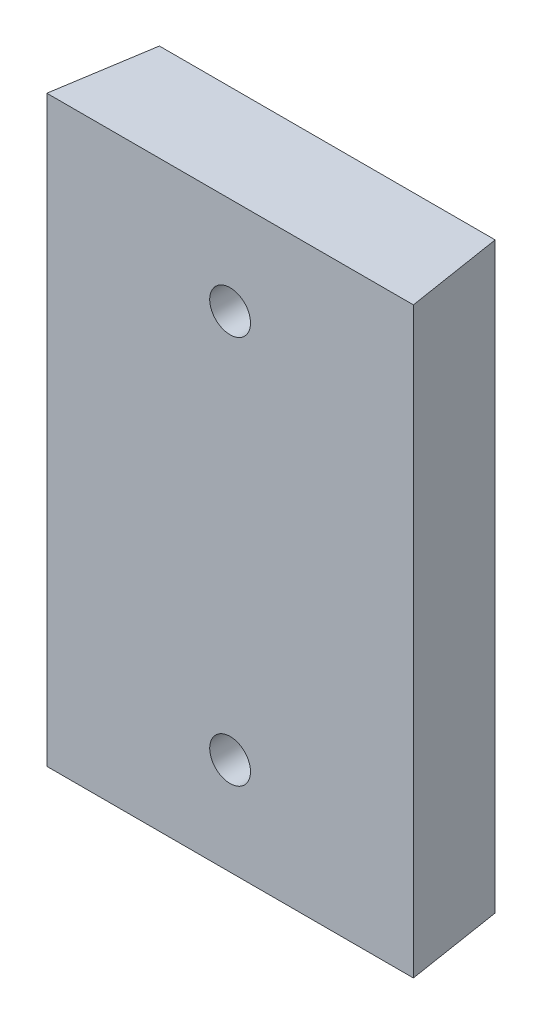
ISO-10303-21;
HEADER;
FILE_DESCRIPTION(('STEP AP214'),'2;1');
FILE_NAME('part.step','',(''),(''),'','','');
FILE_SCHEMA(('AUTOMOTIVE_DESIGN { 1 0 10303 214 1 1 1 1 }'));
ENDSEC;
DATA;
#1=APPLICATION_CONTEXT('core data for automotive mechanical design processes');
#2=APPLICATION_PROTOCOL_DEFINITION('international standard','automotive_design',2000,#1);
#3=PRODUCT_CONTEXT('',#1,'mechanical');
#4=PRODUCT('Part','Part','',(#3));
#5=PRODUCT_RELATED_PRODUCT_CATEGORY('part','',(#4));
#6=PRODUCT_DEFINITION_FORMATION('','',#4);
#7=PRODUCT_DEFINITION_CONTEXT('part definition',#1,'design');
#8=PRODUCT_DEFINITION('design','',#6,#7);
#9=PRODUCT_DEFINITION_SHAPE('','',#8);
#10=(LENGTH_UNIT() NAMED_UNIT(*) SI_UNIT(.MILLI.,.METRE.));
#11=(NAMED_UNIT(*) PLANE_ANGLE_UNIT() SI_UNIT($,.RADIAN.));
#12=(NAMED_UNIT(*) SI_UNIT($,.STERADIAN.) SOLID_ANGLE_UNIT());
#13=UNCERTAINTY_MEASURE_WITH_UNIT(LENGTH_MEASURE(1.E-05),#10,'distance_accuracy_value','');
#14=(GEOMETRIC_REPRESENTATION_CONTEXT(3) GLOBAL_UNCERTAINTY_ASSIGNED_CONTEXT((#13)) GLOBAL_UNIT_ASSIGNED_CONTEXT((#10,
#11,#12)) REPRESENTATION_CONTEXT('',''));
#15=CARTESIAN_POINT('',(0.,0.,0.));
#16=DIRECTION('',(0.,0.,1.));
#17=DIRECTION('',(1.,0.,0.));
#18=AXIS2_PLACEMENT_3D('',#15,#16,#17);
#19=CARTESIAN_POINT('',(0.,0.,10.));
#20=DIRECTION('',(0.,0.,-1.));
#21=DIRECTION('',(-1.,0.,0.));
#22=AXIS2_PLACEMENT_3D('',#19,#20,#21);
#23=PLANE('',#22);
#24=DIRECTION('',(1.,0.,0.));
#25=VECTOR('',#24,1.);
#26=CARTESIAN_POINT('',(-21.9008251056324,-30.,10.));
#27=LINE('',#26,#25);
#28=CARTESIAN_POINT('',(-18.8634297282684,-30.,10.));
#29=VERTEX_POINT('',#28);
#30=CARTESIAN_POINT('',(18.8634297282684,-30.,10.));
#31=VERTEX_POINT('',#30);
#32=EDGE_CURVE('E80',#29,#31,#27,.T.);
#33=ORIENTED_EDGE('',*,*,#32,.T.);
#34=DIRECTION('',(0.,1.,0.));
#35=VECTOR('',#34,1.);
#36=CARTESIAN_POINT('',(18.8634297282684,0.,10.));
#37=LINE('',#36,#35);
#38=CARTESIAN_POINT('',(18.8634297282684,30.,10.));
#39=VERTEX_POINT('',#38);
#40=EDGE_CURVE('E73',#31,#39,#37,.T.);
#41=ORIENTED_EDGE('',*,*,#40,.T.);
#42=DIRECTION('',(-1.,0.,0.));
#43=VECTOR('',#42,1.);
#44=CARTESIAN_POINT('',(-21.9008251056324,30.,10.));
#45=LINE('',#44,#43);
#46=CARTESIAN_POINT('',(-18.8634297282684,30.,10.));
#47=VERTEX_POINT('',#46);
#48=EDGE_CURVE('E55',#39,#47,#45,.T.);
#49=ORIENTED_EDGE('',*,*,#48,.T.);
#50=DIRECTION('',(0.,-1.,0.));
#51=VECTOR('',#50,1.);
#52=CARTESIAN_POINT('',(-18.8634297282684,0.,10.));
#53=LINE('',#52,#51);
#54=EDGE_CURVE('E101',#47,#29,#53,.T.);
#55=ORIENTED_EDGE('',*,*,#54,.T.);
#56=EDGE_LOOP('',(#33,#41,#49,#55));
#57=FACE_BOUND('',#56,.T.);
#58=CARTESIAN_POINT('',(0.,-20.,10.));
#59=DIRECTION('',(0.,0.,1.));
#60=DIRECTION('',(1.,0.,0.));
#61=AXIS2_PLACEMENT_3D('',#58,#59,#60);
#62=CIRCLE('',#61,2.10000000000001);
#63=CARTESIAN_POINT('',(2.09999999999993,-20.,10.));
#64=VERTEX_POINT('',#63);
#65=EDGE_CURVE('E94',#64,#64,#62,.T.);
#66=ORIENTED_EDGE('',*,*,#65,.F.);
#67=EDGE_LOOP('',(#66));
#68=FACE_BOUND('',#67,.T.);
#69=CARTESIAN_POINT('',(0.,20.,10.));
#70=DIRECTION('',(0.,0.,1.));
#71=DIRECTION('',(1.,0.,0.));
#72=AXIS2_PLACEMENT_3D('',#69,#70,#71);
#73=CIRCLE('',#72,2.10000000000001);
#74=CARTESIAN_POINT('',(2.09999999999993,20.,10.));
#75=VERTEX_POINT('',#74);
#76=EDGE_CURVE('E110',#75,#75,#73,.T.);
#77=ORIENTED_EDGE('',*,*,#76,.F.);
#78=EDGE_LOOP('',(#77));
#79=FACE_BOUND('',#78,.T.);
#80=ADVANCED_FACE('F33',(#57,#68,#79),#23,.F.);
#81=CARTESIAN_POINT('',(0.,0.,0.));
#82=DIRECTION('',(0.,0.,-1.));
#83=DIRECTION('',(-1.,0.,0.));
#84=AXIS2_PLACEMENT_3D('',#81,#82,#83);
#85=PLANE('',#84);
#86=DIRECTION('',(0.,1.,0.));
#87=VECTOR('',#86,1.);
#88=CARTESIAN_POINT('',(17.2795853250231,0.,0.));
#89=LINE('',#88,#87);
#90=CARTESIAN_POINT('',(17.2795853250231,-30.,0.));
#91=VERTEX_POINT('',#90);
#92=CARTESIAN_POINT('',(17.2795853250231,30.,0.));
#93=VERTEX_POINT('',#92);
#94=EDGE_CURVE('E48',#91,#93,#89,.T.);
#95=ORIENTED_EDGE('',*,*,#94,.F.);
#96=DIRECTION('',(1.,0.,0.));
#97=VECTOR('',#96,1.);
#98=CARTESIAN_POINT('',(-21.9008251056324,-30.,0.));
#99=LINE('',#98,#97);
#100=CARTESIAN_POINT('',(-17.2795853250231,-30.,0.));
#101=VERTEX_POINT('',#100);
#102=EDGE_CURVE('E91',#101,#91,#99,.T.);
#103=ORIENTED_EDGE('',*,*,#102,.F.);
#104=DIRECTION('',(0.,-1.,0.));
#105=VECTOR('',#104,1.);
#106=CARTESIAN_POINT('',(-17.2795853250231,0.,0.));
#107=LINE('',#106,#105);
#108=CARTESIAN_POINT('',(-17.2795853250231,30.,0.));
#109=VERTEX_POINT('',#108);
#110=EDGE_CURVE('E99',#109,#101,#107,.T.);
#111=ORIENTED_EDGE('',*,*,#110,.F.);
#112=DIRECTION('',(-1.,0.,0.));
#113=VECTOR('',#112,1.);
#114=CARTESIAN_POINT('',(-21.9008251056324,30.,0.));
#115=LINE('',#114,#113);
#116=EDGE_CURVE('E87',#93,#109,#115,.T.);
#117=ORIENTED_EDGE('',*,*,#116,.F.);
#118=EDGE_LOOP('',(#95,#103,#111,#117));
#119=FACE_BOUND('',#118,.T.);
#120=CARTESIAN_POINT('',(0.,-20.,0.));
#121=DIRECTION('',(0.,0.,1.));
#122=DIRECTION('',(1.,0.,0.));
#123=AXIS2_PLACEMENT_3D('',#120,#121,#122);
#124=CIRCLE('',#123,2.10000000000001);
#125=CARTESIAN_POINT('',(2.09999999999993,-20.,0.));
#126=VERTEX_POINT('',#125);
#127=EDGE_CURVE('E113',#126,#126,#124,.T.);
#128=ORIENTED_EDGE('',*,*,#127,.T.);
#129=EDGE_LOOP('',(#128));
#130=FACE_BOUND('',#129,.T.);
#131=CARTESIAN_POINT('',(0.,20.,0.));
#132=DIRECTION('',(0.,0.,1.));
#133=DIRECTION('',(1.,0.,0.));
#134=AXIS2_PLACEMENT_3D('',#131,#132,#133);
#135=CIRCLE('',#134,2.10000000000001);
#136=CARTESIAN_POINT('',(2.09999999999993,20.,0.));
#137=VERTEX_POINT('',#136);
#138=EDGE_CURVE('E106',#137,#137,#135,.T.);
#139=ORIENTED_EDGE('',*,*,#138,.T.);
#140=EDGE_LOOP('',(#139));
#141=FACE_BOUND('',#140,.T.);
#142=ADVANCED_FACE('F103',(#119,#130,#141),#85,.T.);
#143=CARTESIAN_POINT('',(-21.9008251056324,-30.,10.));
#144=DIRECTION('',(0.,1.,0.));
#145=DIRECTION('',(0.,0.,1.));
#146=AXIS2_PLACEMENT_3D('',#143,#144,#145);
#147=PLANE('',#146);
#148=ORIENTED_EDGE('',*,*,#102,.T.);
#149=DIRECTION('',(0.156434465040228,0.,0.987688340595138));
#150=VECTOR('',#149,1.);
#151=CARTESIAN_POINT('',(17.8658574071668,-30.,3.70157624664689));
#152=LINE('',#151,#150);
#153=EDGE_CURVE('E144',#91,#31,#152,.T.);
#154=ORIENTED_EDGE('',*,*,#153,.T.);
#155=ORIENTED_EDGE('',*,*,#32,.F.);
#156=DIRECTION('',(0.156434465040228,0.,-0.987688340595138));
#157=VECTOR('',#156,1.);
#158=CARTESIAN_POINT('',(-18.937760083847,-30.,10.4693033951207));
#159=LINE('',#158,#157);
#160=EDGE_CURVE('E81',#29,#101,#159,.T.);
#161=ORIENTED_EDGE('',*,*,#160,.T.);
#162=EDGE_LOOP('',(#148,#154,#155,#161));
#163=FACE_BOUND('',#162,.T.);
#164=ADVANCED_FACE('F35',(#163),#147,.F.);
#165=CARTESIAN_POINT('',(-21.9008251056324,30.,10.));
#166=DIRECTION('',(0.,-1.,0.));
#167=DIRECTION('',(0.,0.,-1.));
#168=AXIS2_PLACEMENT_3D('',#165,#166,#167);
#169=PLANE('',#168);
#170=ORIENTED_EDGE('',*,*,#48,.F.);
#171=DIRECTION('',(-0.156434465040228,0.,-0.987688340595138));
#172=VECTOR('',#171,1.);
#173=CARTESIAN_POINT('',(17.8658574071668,30.,3.70157624664689));
#174=LINE('',#173,#172);
#175=EDGE_CURVE('E11',#39,#93,#174,.T.);
#176=ORIENTED_EDGE('',*,*,#175,.T.);
#177=ORIENTED_EDGE('',*,*,#116,.T.);
#178=DIRECTION('',(-0.156434465040228,0.,0.987688340595138));
#179=VECTOR('',#178,1.);
#180=CARTESIAN_POINT('',(-18.937760083847,30.,10.4693033951207));
#181=LINE('',#180,#179);
#182=EDGE_CURVE('E41',#109,#47,#181,.T.);
#183=ORIENTED_EDGE('',*,*,#182,.T.);
#184=EDGE_LOOP('',(#170,#176,#177,#183));
#185=FACE_BOUND('',#184,.T.);
#186=ADVANCED_FACE('F84',(#185),#169,.F.);
#187=CARTESIAN_POINT('',(0.,-20.,10.));
#188=DIRECTION('',(0.,0.,-1.));
#189=DIRECTION('',(-1.,0.,0.));
#190=AXIS2_PLACEMENT_3D('',#187,#188,#189);
#191=CYLINDRICAL_SURFACE('',#190,2.10000000000001);
#192=ORIENTED_EDGE('',*,*,#65,.T.);
#193=EDGE_LOOP('',(#192));
#194=FACE_BOUND('',#193,.T.);
#195=ORIENTED_EDGE('',*,*,#127,.F.);
#196=EDGE_LOOP('',(#195));
#197=FACE_BOUND('',#196,.T.);
#198=ADVANCED_FACE('F121',(#194,#197),#191,.F.);
#199=CARTESIAN_POINT('',(0.,20.,10.));
#200=DIRECTION('',(0.,0.,-1.));
#201=DIRECTION('',(-1.,0.,0.));
#202=AXIS2_PLACEMENT_3D('',#199,#200,#201);
#203=CYLINDRICAL_SURFACE('',#202,2.10000000000001);
#204=ORIENTED_EDGE('',*,*,#76,.T.);
#205=EDGE_LOOP('',(#204));
#206=FACE_BOUND('',#205,.T.);
#207=ORIENTED_EDGE('',*,*,#138,.F.);
#208=EDGE_LOOP('',(#207));
#209=FACE_BOUND('',#208,.T.);
#210=ADVANCED_FACE('F123',(#206,#209),#203,.F.);
#211=CARTESIAN_POINT('',(-18.937760083847,-51.0000000000001,10.4693033951207));
#212=DIRECTION('',(0.987688340595138,0.,0.156434465040228));
#213=DIRECTION('',(0.156434465040228,0.,-0.987688340595138));
#214=AXIS2_PLACEMENT_3D('',#211,#212,#213);
#215=PLANE('',#214);
#216=ORIENTED_EDGE('',*,*,#182,.F.);
#217=ORIENTED_EDGE('',*,*,#110,.T.);
#218=ORIENTED_EDGE('',*,*,#160,.F.);
#219=ORIENTED_EDGE('',*,*,#54,.F.);
#220=EDGE_LOOP('',(#216,#217,#218,#219));
#221=FACE_BOUND('',#220,.T.);
#222=ADVANCED_FACE('F98',(#221),#215,.F.);
#223=CARTESIAN_POINT('',(18.937760083847,-51.0000000000001,10.4693033951207));
#224=DIRECTION('',(-0.987688340595138,0.,0.156434465040228));
#225=DIRECTION('',(0.156434465040228,0.,0.987688340595138));
#226=AXIS2_PLACEMENT_3D('',#223,#224,#225);
#227=PLANE('',#226);
#228=ORIENTED_EDGE('',*,*,#153,.F.);
#229=ORIENTED_EDGE('',*,*,#94,.T.);
#230=ORIENTED_EDGE('',*,*,#175,.F.);
#231=ORIENTED_EDGE('',*,*,#40,.F.);
#232=EDGE_LOOP('',(#228,#229,#230,#231));
#233=FACE_BOUND('',#232,.T.);
#234=ADVANCED_FACE('F72',(#233),#227,.F.);
#235=CLOSED_SHELL('',(#80,#142,#164,#186,#198,#210,#222,#234));
#236=MANIFOLD_SOLID_BREP('B2',#235);
#237=ADVANCED_BREP_SHAPE_REPRESENTATION('',(#18,#236),#14);
#238=SHAPE_DEFINITION_REPRESENTATION(#9,#237);
ENDSEC;
END-ISO-10303-21;
